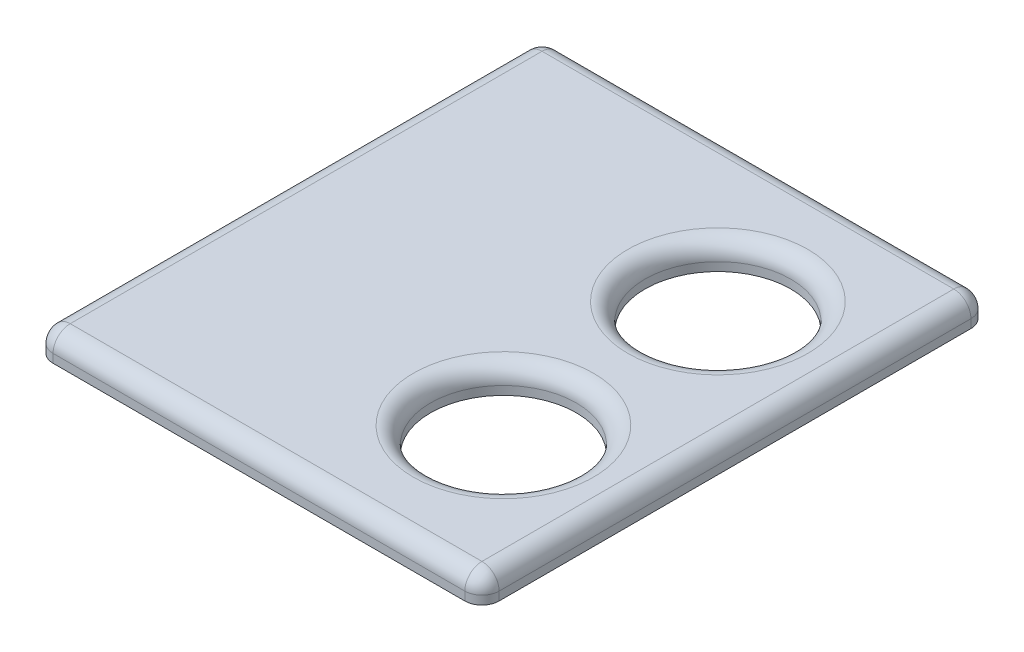
ISO-10303-21;
HEADER;
FILE_DESCRIPTION(('STEP AP214'),'2;1');
FILE_NAME('part.step','',(''),(''),'','','');
FILE_SCHEMA(('AUTOMOTIVE_DESIGN { 1 0 10303 214 1 1 1 1 }'));
ENDSEC;
DATA;
#1=APPLICATION_CONTEXT('core data for automotive mechanical design processes');
#2=APPLICATION_PROTOCOL_DEFINITION('international standard','automotive_design',2000,#1);
#3=PRODUCT_CONTEXT('',#1,'mechanical');
#4=PRODUCT('Part','Part','',(#3));
#5=PRODUCT_RELATED_PRODUCT_CATEGORY('part','',(#4));
#6=PRODUCT_DEFINITION_FORMATION('','',#4);
#7=PRODUCT_DEFINITION_CONTEXT('part definition',#1,'design');
#8=PRODUCT_DEFINITION('design','',#6,#7);
#9=PRODUCT_DEFINITION_SHAPE('','',#8);
#10=(LENGTH_UNIT() NAMED_UNIT(*) SI_UNIT(.MILLI.,.METRE.));
#11=(NAMED_UNIT(*) PLANE_ANGLE_UNIT() SI_UNIT($,.RADIAN.));
#12=(NAMED_UNIT(*) SI_UNIT($,.STERADIAN.) SOLID_ANGLE_UNIT());
#13=UNCERTAINTY_MEASURE_WITH_UNIT(LENGTH_MEASURE(1.E-05),#10,'distance_accuracy_value','');
#14=(GEOMETRIC_REPRESENTATION_CONTEXT(3) GLOBAL_UNCERTAINTY_ASSIGNED_CONTEXT((#13)) GLOBAL_UNIT_ASSIGNED_CONTEXT((#10,
#11,#12)) REPRESENTATION_CONTEXT('',''));
#15=CARTESIAN_POINT('',(0.,0.,0.));
#16=DIRECTION('',(0.,0.,1.));
#17=DIRECTION('',(1.,0.,0.));
#18=AXIS2_PLACEMENT_3D('',#15,#16,#17);
#19=CARTESIAN_POINT('',(37.5,21.,0.));
#20=DIRECTION('',(-1.,0.,0.));
#21=DIRECTION('',(0.,0.,1.));
#22=AXIS2_PLACEMENT_3D('',#19,#20,#21);
#23=PLANE('',#22);
#24=DIRECTION('',(0.,0.,-1.));
#25=VECTOR('',#24,1.);
#26=CARTESIAN_POINT('',(37.5,18.,0.));
#27=LINE('',#26,#25);
#28=CARTESIAN_POINT('',(37.5,18.,27.5));
#29=VERTEX_POINT('',#28);
#30=CARTESIAN_POINT('',(37.5,18.,-27.5));
#31=VERTEX_POINT('',#30);
#32=EDGE_CURVE('E218',#29,#31,#27,.T.);
#33=ORIENTED_EDGE('',*,*,#32,.T.);
#34=DIRECTION('',(0.,-1.,0.));
#35=VECTOR('',#34,1.);
#36=CARTESIAN_POINT('',(37.5,21.,-27.5));
#37=LINE('',#36,#35);
#38=CARTESIAN_POINT('',(37.5,19.,-27.5));
#39=VERTEX_POINT('',#38);
#40=EDGE_CURVE('E58',#31,#39,#37,.F.);
#41=ORIENTED_EDGE('',*,*,#40,.T.);
#42=DIRECTION('',(0.,0.,-1.));
#43=VECTOR('',#42,1.);
#44=CARTESIAN_POINT('',(37.5,19.,29.5));
#45=LINE('',#44,#43);
#46=CARTESIAN_POINT('',(37.5,19.,27.5));
#47=VERTEX_POINT('',#46);
#48=EDGE_CURVE('E63',#39,#47,#45,.F.);
#49=ORIENTED_EDGE('',*,*,#48,.T.);
#50=DIRECTION('',(0.,-1.,0.));
#51=VECTOR('',#50,1.);
#52=CARTESIAN_POINT('',(37.5,21.,27.5));
#53=LINE('',#52,#51);
#54=EDGE_CURVE('E187',#47,#29,#53,.T.);
#55=ORIENTED_EDGE('',*,*,#54,.T.);
#56=EDGE_LOOP('',(#33,#41,#49,#55));
#57=FACE_BOUND('',#56,.T.);
#58=ADVANCED_FACE('F41',(#57),#23,.F.);
#59=CARTESIAN_POINT('',(0.,21.,-29.5));
#60=DIRECTION('',(0.,0.,1.));
#61=DIRECTION('',(1.,0.,0.));
#62=AXIS2_PLACEMENT_3D('',#59,#60,#61);
#63=PLANE('',#62);
#64=DIRECTION('',(-1.,0.,0.));
#65=VECTOR('',#64,1.);
#66=CARTESIAN_POINT('',(37.5,19.,-29.5));
#67=LINE('',#66,#65);
#68=CARTESIAN_POINT('',(-12.5,19.,-29.5));
#69=VERTEX_POINT('',#68);
#70=CARTESIAN_POINT('',(35.5,19.,-29.5));
#71=VERTEX_POINT('',#70);
#72=EDGE_CURVE('E183',#69,#71,#67,.F.);
#73=ORIENTED_EDGE('',*,*,#72,.T.);
#74=DIRECTION('',(0.,-1.,0.));
#75=VECTOR('',#74,1.);
#76=CARTESIAN_POINT('',(35.5,21.,-29.5));
#77=LINE('',#76,#75);
#78=CARTESIAN_POINT('',(35.5,18.,-29.5));
#79=VERTEX_POINT('',#78);
#80=EDGE_CURVE('E185',#71,#79,#77,.T.);
#81=ORIENTED_EDGE('',*,*,#80,.T.);
#82=DIRECTION('',(-1.,0.,0.));
#83=VECTOR('',#82,1.);
#84=CARTESIAN_POINT('',(0.,18.,-29.5));
#85=LINE('',#84,#83);
#86=CARTESIAN_POINT('',(-12.5,18.,-29.5));
#87=VERTEX_POINT('',#86);
#88=EDGE_CURVE('E220',#79,#87,#85,.T.);
#89=ORIENTED_EDGE('',*,*,#88,.T.);
#90=DIRECTION('',(0.,-1.,0.));
#91=VECTOR('',#90,1.);
#92=CARTESIAN_POINT('',(-12.5,21.,-29.5));
#93=LINE('',#92,#91);
#94=EDGE_CURVE('E181',#87,#69,#93,.F.);
#95=ORIENTED_EDGE('',*,*,#94,.T.);
#96=EDGE_LOOP('',(#73,#81,#89,#95));
#97=FACE_BOUND('',#96,.T.);
#98=ADVANCED_FACE('F280',(#97),#63,.F.);
#99=CARTESIAN_POINT('',(-14.5,21.,0.));
#100=DIRECTION('',(1.,0.,0.));
#101=DIRECTION('',(0.,0.,-1.));
#102=AXIS2_PLACEMENT_3D('',#99,#100,#101);
#103=PLANE('',#102);
#104=DIRECTION('',(0.,0.,1.));
#105=VECTOR('',#104,1.);
#106=CARTESIAN_POINT('',(-14.5,19.,-29.5));
#107=LINE('',#106,#105);
#108=CARTESIAN_POINT('',(-14.5,19.,27.5));
#109=VERTEX_POINT('',#108);
#110=CARTESIAN_POINT('',(-14.5,19.,-27.5));
#111=VERTEX_POINT('',#110);
#112=EDGE_CURVE('E177',#109,#111,#107,.F.);
#113=ORIENTED_EDGE('',*,*,#112,.T.);
#114=DIRECTION('',(0.,-1.,0.));
#115=VECTOR('',#114,1.);
#116=CARTESIAN_POINT('',(-14.5,21.,-27.5));
#117=LINE('',#116,#115);
#118=CARTESIAN_POINT('',(-14.5,18.,-27.5));
#119=VERTEX_POINT('',#118);
#120=EDGE_CURVE('E179',#111,#119,#117,.T.);
#121=ORIENTED_EDGE('',*,*,#120,.T.);
#122=DIRECTION('',(0.,0.,1.));
#123=VECTOR('',#122,1.);
#124=CARTESIAN_POINT('',(-14.5,18.,0.));
#125=LINE('',#124,#123);
#126=CARTESIAN_POINT('',(-14.5,18.,27.5));
#127=VERTEX_POINT('',#126);
#128=EDGE_CURVE('E224',#119,#127,#125,.T.);
#129=ORIENTED_EDGE('',*,*,#128,.T.);
#130=DIRECTION('',(0.,-1.,0.));
#131=VECTOR('',#130,1.);
#132=CARTESIAN_POINT('',(-14.5,21.,27.5));
#133=LINE('',#132,#131);
#134=EDGE_CURVE('E175',#127,#109,#133,.F.);
#135=ORIENTED_EDGE('',*,*,#134,.T.);
#136=EDGE_LOOP('',(#113,#121,#129,#135));
#137=FACE_BOUND('',#136,.T.);
#138=ADVANCED_FACE('F287',(#137),#103,.F.);
#139=CARTESIAN_POINT('',(23.,21.,-12.5));
#140=DIRECTION('',(0.,-1.,0.));
#141=DIRECTION('',(0.,0.,-1.));
#142=AXIS2_PLACEMENT_3D('',#139,#140,#141);
#143=CYLINDRICAL_SURFACE('',#142,8.5);
#144=CARTESIAN_POINT('',(23.,19.,-12.5));
#145=DIRECTION('',(0.,1.,0.));
#146=DIRECTION('',(0.,0.,1.));
#147=AXIS2_PLACEMENT_3D('',#144,#145,#146);
#148=CIRCLE('',#147,8.5);
#149=CARTESIAN_POINT('',(23.,19.,-4.));
#150=VERTEX_POINT('',#149);
#151=EDGE_CURVE('E167',#150,#150,#148,.T.);
#152=ORIENTED_EDGE('',*,*,#151,.T.);
#153=EDGE_LOOP('',(#152));
#154=FACE_BOUND('',#153,.T.);
#155=CARTESIAN_POINT('',(23.,18.,-12.5));
#156=DIRECTION('',(0.,1.,0.));
#157=DIRECTION('',(0.,0.,1.));
#158=AXIS2_PLACEMENT_3D('',#155,#156,#157);
#159=CIRCLE('',#158,8.5);
#160=CARTESIAN_POINT('',(23.,18.,-4.));
#161=VERTEX_POINT('',#160);
#162=EDGE_CURVE('E232',#161,#161,#159,.T.);
#163=ORIENTED_EDGE('',*,*,#162,.F.);
#164=EDGE_LOOP('',(#163));
#165=FACE_BOUND('',#164,.T.);
#166=ADVANCED_FACE('F433',(#154,#165),#143,.F.);
#167=CARTESIAN_POINT('',(0.,21.,29.5));
#168=DIRECTION('',(0.,0.,-1.));
#169=DIRECTION('',(-1.,0.,0.));
#170=AXIS2_PLACEMENT_3D('',#167,#168,#169);
#171=PLANE('',#170);
#172=DIRECTION('',(1.,0.,0.));
#173=VECTOR('',#172,1.);
#174=CARTESIAN_POINT('',(-14.5,19.,29.5));
#175=LINE('',#174,#173);
#176=CARTESIAN_POINT('',(35.5,19.,29.5));
#177=VERTEX_POINT('',#176);
#178=CARTESIAN_POINT('',(-12.5,19.,29.5));
#179=VERTEX_POINT('',#178);
#180=EDGE_CURVE('E126',#177,#179,#175,.F.);
#181=ORIENTED_EDGE('',*,*,#180,.T.);
#182=DIRECTION('',(0.,-1.,0.));
#183=VECTOR('',#182,1.);
#184=CARTESIAN_POINT('',(-12.5,21.,29.5));
#185=LINE('',#184,#183);
#186=CARTESIAN_POINT('',(-12.5,18.,29.5));
#187=VERTEX_POINT('',#186);
#188=EDGE_CURVE('E173',#179,#187,#185,.T.);
#189=ORIENTED_EDGE('',*,*,#188,.T.);
#190=DIRECTION('',(1.,0.,0.));
#191=VECTOR('',#190,1.);
#192=CARTESIAN_POINT('',(0.,18.,29.5));
#193=LINE('',#192,#191);
#194=CARTESIAN_POINT('',(35.5,18.,29.5));
#195=VERTEX_POINT('',#194);
#196=EDGE_CURVE('E229',#187,#195,#193,.T.);
#197=ORIENTED_EDGE('',*,*,#196,.T.);
#198=DIRECTION('',(0.,-1.,0.));
#199=VECTOR('',#198,1.);
#200=CARTESIAN_POINT('',(35.5,21.,29.5));
#201=LINE('',#200,#199);
#202=EDGE_CURVE('E170',#195,#177,#201,.F.);
#203=ORIENTED_EDGE('',*,*,#202,.T.);
#204=EDGE_LOOP('',(#181,#189,#197,#203));
#205=FACE_BOUND('',#204,.T.);
#206=ADVANCED_FACE('F255',(#205),#171,.F.);
#207=CARTESIAN_POINT('',(23.,21.,12.5));
#208=DIRECTION('',(0.,-1.,0.));
#209=DIRECTION('',(0.,0.,-1.));
#210=AXIS2_PLACEMENT_3D('',#207,#208,#209);
#211=CYLINDRICAL_SURFACE('',#210,8.5);
#212=CARTESIAN_POINT('',(23.,19.,12.5));
#213=DIRECTION('',(0.,1.,0.));
#214=DIRECTION('',(0.,0.,1.));
#215=AXIS2_PLACEMENT_3D('',#212,#213,#214);
#216=CIRCLE('',#215,8.5);
#217=CARTESIAN_POINT('',(23.,19.,21.));
#218=VERTEX_POINT('',#217);
#219=EDGE_CURVE('E164',#218,#218,#216,.T.);
#220=ORIENTED_EDGE('',*,*,#219,.T.);
#221=EDGE_LOOP('',(#220));
#222=FACE_BOUND('',#221,.T.);
#223=CARTESIAN_POINT('',(23.,18.,12.5));
#224=DIRECTION('',(0.,1.,0.));
#225=DIRECTION('',(0.,0.,1.));
#226=AXIS2_PLACEMENT_3D('',#223,#224,#225);
#227=CIRCLE('',#226,8.5);
#228=CARTESIAN_POINT('',(23.,18.,21.));
#229=VERTEX_POINT('',#228);
#230=EDGE_CURVE('E148',#229,#229,#227,.F.);
#231=ORIENTED_EDGE('',*,*,#230,.T.);
#232=EDGE_LOOP('',(#231));
#233=FACE_BOUND('',#232,.T.);
#234=ADVANCED_FACE('F414',(#222,#233),#211,.F.);
#235=CARTESIAN_POINT('',(0.,21.,0.));
#236=DIRECTION('',(0.,1.,0.));
#237=DIRECTION('',(0.,0.,1.));
#238=AXIS2_PLACEMENT_3D('',#235,#236,#237);
#239=PLANE('',#238);
#240=CARTESIAN_POINT('',(23.,21.,12.5));
#241=DIRECTION('',(0.,1.,0.));
#242=DIRECTION('',(0.,0.,1.));
#243=AXIS2_PLACEMENT_3D('',#240,#241,#242);
#244=CIRCLE('',#243,10.5);
#245=CARTESIAN_POINT('',(23.,21.,23.));
#246=VERTEX_POINT('',#245);
#247=EDGE_CURVE('E157',#246,#246,#244,.F.);
#248=ORIENTED_EDGE('',*,*,#247,.T.);
#249=EDGE_LOOP('',(#248));
#250=FACE_BOUND('',#249,.T.);
#251=CARTESIAN_POINT('',(23.,21.,-12.5));
#252=DIRECTION('',(0.,1.,0.));
#253=DIRECTION('',(0.,0.,1.));
#254=AXIS2_PLACEMENT_3D('',#251,#252,#253);
#255=CIRCLE('',#254,10.5);
#256=CARTESIAN_POINT('',(23.,21.,-2.));
#257=VERTEX_POINT('',#256);
#258=EDGE_CURVE('E154',#257,#257,#255,.F.);
#259=ORIENTED_EDGE('',*,*,#258,.T.);
#260=EDGE_LOOP('',(#259));
#261=FACE_BOUND('',#260,.T.);
#262=DIRECTION('',(0.,0.,1.));
#263=VECTOR('',#262,1.);
#264=CARTESIAN_POINT('',(-12.5,21.,29.5));
#265=LINE('',#264,#263);
#266=CARTESIAN_POINT('',(-12.5,21.,-27.5));
#267=VERTEX_POINT('',#266);
#268=CARTESIAN_POINT('',(-12.5,21.,27.5));
#269=VERTEX_POINT('',#268);
#270=EDGE_CURVE('E152',#267,#269,#265,.T.);
#271=ORIENTED_EDGE('',*,*,#270,.T.);
#272=DIRECTION('',(1.,0.,0.));
#273=VECTOR('',#272,1.);
#274=CARTESIAN_POINT('',(37.5,21.,27.5));
#275=LINE('',#274,#273);
#276=CARTESIAN_POINT('',(35.5,21.,27.5));
#277=VERTEX_POINT('',#276);
#278=EDGE_CURVE('E124',#269,#277,#275,.T.);
#279=ORIENTED_EDGE('',*,*,#278,.T.);
#280=DIRECTION('',(0.,0.,-1.));
#281=VECTOR('',#280,1.);
#282=CARTESIAN_POINT('',(35.5,21.,-29.5));
#283=LINE('',#282,#281);
#284=CARTESIAN_POINT('',(35.5,21.,-27.5));
#285=VERTEX_POINT('',#284);
#286=EDGE_CURVE('E141',#277,#285,#283,.T.);
#287=ORIENTED_EDGE('',*,*,#286,.T.);
#288=DIRECTION('',(-1.,0.,0.));
#289=VECTOR('',#288,1.);
#290=CARTESIAN_POINT('',(-14.5,21.,-27.5));
#291=LINE('',#290,#289);
#292=EDGE_CURVE('E147',#285,#267,#291,.T.);
#293=ORIENTED_EDGE('',*,*,#292,.T.);
#294=EDGE_LOOP('',(#271,#279,#287,#293));
#295=FACE_BOUND('',#294,.T.);
#296=ADVANCED_FACE('F150',(#250,#261,#295),#239,.T.);
#297=CARTESIAN_POINT('',(0.,18.,0.));
#298=DIRECTION('',(0.,1.,0.));
#299=DIRECTION('',(0.,0.,1.));
#300=AXIS2_PLACEMENT_3D('',#297,#298,#299);
#301=PLANE('',#300);
#302=ORIENTED_EDGE('',*,*,#88,.F.);
#303=CARTESIAN_POINT('',(35.5,18.,-27.5));
#304=DIRECTION('',(0.,1.,0.));
#305=DIRECTION('',(0.,0.,1.));
#306=AXIS2_PLACEMENT_3D('',#303,#304,#305);
#307=CIRCLE('',#306,2.);
#308=EDGE_CURVE('E11',#79,#31,#307,.F.);
#309=ORIENTED_EDGE('',*,*,#308,.T.);
#310=ORIENTED_EDGE('',*,*,#32,.F.);
#311=CARTESIAN_POINT('',(35.5,18.,27.5));
#312=DIRECTION('',(0.,1.,0.));
#313=DIRECTION('',(0.,0.,1.));
#314=AXIS2_PLACEMENT_3D('',#311,#312,#313);
#315=CIRCLE('',#314,2.);
#316=EDGE_CURVE('E191',#29,#195,#315,.F.);
#317=ORIENTED_EDGE('',*,*,#316,.T.);
#318=ORIENTED_EDGE('',*,*,#196,.F.);
#319=CARTESIAN_POINT('',(-12.5,18.,27.5));
#320=DIRECTION('',(0.,1.,0.));
#321=DIRECTION('',(0.,0.,1.));
#322=AXIS2_PLACEMENT_3D('',#319,#320,#321);
#323=CIRCLE('',#322,2.);
#324=EDGE_CURVE('E193',#187,#127,#323,.F.);
#325=ORIENTED_EDGE('',*,*,#324,.T.);
#326=ORIENTED_EDGE('',*,*,#128,.F.);
#327=CARTESIAN_POINT('',(-12.5,18.,-27.5));
#328=DIRECTION('',(0.,1.,0.));
#329=DIRECTION('',(0.,0.,1.));
#330=AXIS2_PLACEMENT_3D('',#327,#328,#329);
#331=CIRCLE('',#330,2.);
#332=EDGE_CURVE('E50',#119,#87,#331,.F.);
#333=ORIENTED_EDGE('',*,*,#332,.T.);
#334=EDGE_LOOP('',(#302,#309,#310,#317,#318,#325,#326,#333));
#335=FACE_BOUND('',#334,.T.);
#336=ORIENTED_EDGE('',*,*,#162,.T.);
#337=EDGE_LOOP('',(#336));
#338=FACE_BOUND('',#337,.T.);
#339=ORIENTED_EDGE('',*,*,#230,.F.);
#340=EDGE_LOOP('',(#339));
#341=FACE_BOUND('',#340,.T.);
#342=ADVANCED_FACE('F262',(#335,#338,#341),#301,.F.);
#343=CARTESIAN_POINT('',(23.,19.,12.5));
#344=DIRECTION('',(0.,1.,0.));
#345=DIRECTION('',(0.,0.,1.));
#346=AXIS2_PLACEMENT_3D('',#343,#344,#345);
#347=TOROIDAL_SURFACE('',#346,10.5,2.);
#348=ORIENTED_EDGE('',*,*,#219,.F.);
#349=EDGE_LOOP('',(#348));
#350=FACE_BOUND('',#349,.T.);
#351=ORIENTED_EDGE('',*,*,#247,.F.);
#352=EDGE_LOOP('',(#351));
#353=FACE_BOUND('',#352,.T.);
#354=ADVANCED_FACE('F292',(#350,#353),#347,.T.);
#355=CARTESIAN_POINT('',(23.,19.,-12.5));
#356=DIRECTION('',(0.,1.,0.));
#357=DIRECTION('',(0.,0.,1.));
#358=AXIS2_PLACEMENT_3D('',#355,#356,#357);
#359=TOROIDAL_SURFACE('',#358,10.5,2.);
#360=ORIENTED_EDGE('',*,*,#258,.F.);
#361=EDGE_LOOP('',(#360));
#362=FACE_BOUND('',#361,.T.);
#363=ORIENTED_EDGE('',*,*,#151,.F.);
#364=EDGE_LOOP('',(#363));
#365=FACE_BOUND('',#364,.T.);
#366=ADVANCED_FACE('F295',(#362,#365),#359,.T.);
#367=CARTESIAN_POINT('',(-12.5,21.,-27.5));
#368=DIRECTION('',(0.,-1.,0.));
#369=DIRECTION('',(0.,0.,-1.));
#370=AXIS2_PLACEMENT_3D('',#367,#368,#369);
#371=CYLINDRICAL_SURFACE('',#370,2.);
#372=ORIENTED_EDGE('',*,*,#332,.F.);
#373=ORIENTED_EDGE('',*,*,#120,.F.);
#374=CARTESIAN_POINT('',(-12.5,19.,-27.5));
#375=DIRECTION('',(0.,1.,0.));
#376=DIRECTION('',(0.,0.,1.));
#377=AXIS2_PLACEMENT_3D('',#374,#375,#376);
#378=CIRCLE('',#377,2.);
#379=EDGE_CURVE('E45',#69,#111,#378,.T.);
#380=ORIENTED_EDGE('',*,*,#379,.F.);
#381=ORIENTED_EDGE('',*,*,#94,.F.);
#382=EDGE_LOOP('',(#372,#373,#380,#381));
#383=FACE_BOUND('',#382,.T.);
#384=ADVANCED_FACE('F43',(#383),#371,.T.);
#385=CARTESIAN_POINT('',(0.,19.,-27.5));
#386=DIRECTION('',(1.,0.,0.));
#387=DIRECTION('',(0.,0.,-1.));
#388=AXIS2_PLACEMENT_3D('',#385,#386,#387);
#389=CYLINDRICAL_SURFACE('',#388,2.);
#390=CARTESIAN_POINT('',(35.5,19.,-27.5));
#391=DIRECTION('',(1.,0.,0.));
#392=DIRECTION('',(0.,0.,-1.));
#393=AXIS2_PLACEMENT_3D('',#390,#391,#392);
#394=CIRCLE('',#393,2.);
#395=EDGE_CURVE('E210',#71,#285,#394,.T.);
#396=ORIENTED_EDGE('',*,*,#395,.F.);
#397=ORIENTED_EDGE('',*,*,#72,.F.);
#398=CARTESIAN_POINT('',(-12.5,19.,-27.5));
#399=DIRECTION('',(-1.,0.,0.));
#400=DIRECTION('',(0.,0.,1.));
#401=AXIS2_PLACEMENT_3D('',#398,#399,#400);
#402=CIRCLE('',#401,2.);
#403=EDGE_CURVE('E212',#267,#69,#402,.T.);
#404=ORIENTED_EDGE('',*,*,#403,.F.);
#405=ORIENTED_EDGE('',*,*,#292,.F.);
#406=EDGE_LOOP('',(#396,#397,#404,#405));
#407=FACE_BOUND('',#406,.T.);
#408=ADVANCED_FACE('F239',(#407),#389,.T.);
#409=CARTESIAN_POINT('',(35.5,21.,-27.5));
#410=DIRECTION('',(0.,-1.,0.));
#411=DIRECTION('',(0.,0.,-1.));
#412=AXIS2_PLACEMENT_3D('',#409,#410,#411);
#413=CYLINDRICAL_SURFACE('',#412,2.);
#414=ORIENTED_EDGE('',*,*,#308,.F.);
#415=ORIENTED_EDGE('',*,*,#80,.F.);
#416=CARTESIAN_POINT('',(35.5,19.,-27.5));
#417=DIRECTION('',(0.,1.,0.));
#418=DIRECTION('',(0.,0.,1.));
#419=AXIS2_PLACEMENT_3D('',#416,#417,#418);
#420=CIRCLE('',#419,2.);
#421=EDGE_CURVE('E207',#39,#71,#420,.T.);
#422=ORIENTED_EDGE('',*,*,#421,.F.);
#423=ORIENTED_EDGE('',*,*,#40,.F.);
#424=EDGE_LOOP('',(#414,#415,#422,#423));
#425=FACE_BOUND('',#424,.T.);
#426=ADVANCED_FACE('F267',(#425),#413,.T.);
#427=CARTESIAN_POINT('',(-12.5,19.,-27.5));
#428=DIRECTION('',(0.,0.,-1.));
#429=DIRECTION('',(-1.,0.,0.));
#430=AXIS2_PLACEMENT_3D('',#427,#428,#429);
#431=SPHERICAL_SURFACE('',#430,2.);
#432=ORIENTED_EDGE('',*,*,#403,.T.);
#433=ORIENTED_EDGE('',*,*,#379,.T.);
#434=CARTESIAN_POINT('',(-12.5,19.,-27.5));
#435=DIRECTION('',(0.,0.,-1.));
#436=DIRECTION('',(0.,1.,0.));
#437=AXIS2_PLACEMENT_3D('',#434,#435,#436);
#438=CIRCLE('',#437,2.);
#439=EDGE_CURVE('E204',#267,#111,#438,.F.);
#440=ORIENTED_EDGE('',*,*,#439,.F.);
#441=EDGE_LOOP('',(#432,#433,#440));
#442=FACE_BOUND('',#441,.T.);
#443=ADVANCED_FACE('F240',(#442),#431,.T.);
#444=CARTESIAN_POINT('',(35.5,19.,-27.5));
#445=DIRECTION('',(0.,0.,-1.));
#446=DIRECTION('',(-1.,0.,0.));
#447=AXIS2_PLACEMENT_3D('',#444,#445,#446);
#448=SPHERICAL_SURFACE('',#447,2.);
#449=ORIENTED_EDGE('',*,*,#421,.T.);
#450=ORIENTED_EDGE('',*,*,#395,.T.);
#451=CARTESIAN_POINT('',(35.5,19.,-27.5));
#452=DIRECTION('',(0.,0.,-1.));
#453=DIRECTION('',(-1.,0.,0.));
#454=AXIS2_PLACEMENT_3D('',#451,#452,#453);
#455=CIRCLE('',#454,2.);
#456=EDGE_CURVE('E144',#39,#285,#455,.F.);
#457=ORIENTED_EDGE('',*,*,#456,.F.);
#458=EDGE_LOOP('',(#449,#450,#457));
#459=FACE_BOUND('',#458,.T.);
#460=ADVANCED_FACE('F269',(#459),#448,.T.);
#461=CARTESIAN_POINT('',(-12.5,21.,27.5));
#462=DIRECTION('',(0.,-1.,0.));
#463=DIRECTION('',(0.,0.,-1.));
#464=AXIS2_PLACEMENT_3D('',#461,#462,#463);
#465=CYLINDRICAL_SURFACE('',#464,2.);
#466=ORIENTED_EDGE('',*,*,#324,.F.);
#467=ORIENTED_EDGE('',*,*,#188,.F.);
#468=CARTESIAN_POINT('',(-12.5,19.,27.5));
#469=DIRECTION('',(0.,1.,0.));
#470=DIRECTION('',(0.,0.,1.));
#471=AXIS2_PLACEMENT_3D('',#468,#469,#470);
#472=CIRCLE('',#471,2.);
#473=EDGE_CURVE('E200',#109,#179,#472,.T.);
#474=ORIENTED_EDGE('',*,*,#473,.F.);
#475=ORIENTED_EDGE('',*,*,#134,.F.);
#476=EDGE_LOOP('',(#466,#467,#474,#475));
#477=FACE_BOUND('',#476,.T.);
#478=ADVANCED_FACE('F252',(#477),#465,.T.);
#479=CARTESIAN_POINT('',(-12.5,19.,0.));
#480=DIRECTION('',(0.,0.,-1.));
#481=DIRECTION('',(-1.,0.,0.));
#482=AXIS2_PLACEMENT_3D('',#479,#480,#481);
#483=CYLINDRICAL_SURFACE('',#482,2.);
#484=ORIENTED_EDGE('',*,*,#439,.T.);
#485=ORIENTED_EDGE('',*,*,#112,.F.);
#486=CARTESIAN_POINT('',(-12.5,19.,27.5));
#487=DIRECTION('',(0.,0.,1.));
#488=DIRECTION('',(1.,0.,0.));
#489=AXIS2_PLACEMENT_3D('',#486,#487,#488);
#490=CIRCLE('',#489,2.);
#491=EDGE_CURVE('E138',#269,#109,#490,.T.);
#492=ORIENTED_EDGE('',*,*,#491,.F.);
#493=ORIENTED_EDGE('',*,*,#270,.F.);
#494=EDGE_LOOP('',(#484,#485,#492,#493));
#495=FACE_BOUND('',#494,.T.);
#496=ADVANCED_FACE('F243',(#495),#483,.T.);
#497=CARTESIAN_POINT('',(35.5,19.,0.));
#498=DIRECTION('',(0.,0.,1.));
#499=DIRECTION('',(1.,0.,0.));
#500=AXIS2_PLACEMENT_3D('',#497,#498,#499);
#501=CYLINDRICAL_SURFACE('',#500,2.);
#502=ORIENTED_EDGE('',*,*,#456,.T.);
#503=ORIENTED_EDGE('',*,*,#286,.F.);
#504=CARTESIAN_POINT('',(35.5,19.,27.5));
#505=DIRECTION('',(0.,0.,1.));
#506=DIRECTION('',(1.,0.,0.));
#507=AXIS2_PLACEMENT_3D('',#504,#505,#506);
#508=CIRCLE('',#507,2.);
#509=EDGE_CURVE('E132',#47,#277,#508,.T.);
#510=ORIENTED_EDGE('',*,*,#509,.F.);
#511=ORIENTED_EDGE('',*,*,#48,.F.);
#512=EDGE_LOOP('',(#502,#503,#510,#511));
#513=FACE_BOUND('',#512,.T.);
#514=ADVANCED_FACE('F142',(#513),#501,.T.);
#515=CARTESIAN_POINT('',(35.5,21.,27.5));
#516=DIRECTION('',(0.,-1.,0.));
#517=DIRECTION('',(0.,0.,-1.));
#518=AXIS2_PLACEMENT_3D('',#515,#516,#517);
#519=CYLINDRICAL_SURFACE('',#518,2.);
#520=ORIENTED_EDGE('',*,*,#316,.F.);
#521=ORIENTED_EDGE('',*,*,#54,.F.);
#522=CARTESIAN_POINT('',(35.5,19.,27.5));
#523=DIRECTION('',(0.,1.,0.));
#524=DIRECTION('',(0.,0.,1.));
#525=AXIS2_PLACEMENT_3D('',#522,#523,#524);
#526=CIRCLE('',#525,2.);
#527=EDGE_CURVE('E136',#177,#47,#526,.T.);
#528=ORIENTED_EDGE('',*,*,#527,.F.);
#529=ORIENTED_EDGE('',*,*,#202,.F.);
#530=EDGE_LOOP('',(#520,#521,#528,#529));
#531=FACE_BOUND('',#530,.T.);
#532=ADVANCED_FACE('F259',(#531),#519,.T.);
#533=CARTESIAN_POINT('',(-12.5,19.,27.5));
#534=DIRECTION('',(-1.,0.,0.));
#535=DIRECTION('',(0.,0.,1.));
#536=AXIS2_PLACEMENT_3D('',#533,#534,#535);
#537=SPHERICAL_SURFACE('',#536,2.);
#538=ORIENTED_EDGE('',*,*,#491,.T.);
#539=ORIENTED_EDGE('',*,*,#473,.T.);
#540=CARTESIAN_POINT('',(-12.5,19.,27.5));
#541=DIRECTION('',(-1.,0.,0.));
#542=DIRECTION('',(0.,0.,1.));
#543=AXIS2_PLACEMENT_3D('',#540,#541,#542);
#544=CIRCLE('',#543,2.);
#545=EDGE_CURVE('E129',#269,#179,#544,.F.);
#546=ORIENTED_EDGE('',*,*,#545,.F.);
#547=EDGE_LOOP('',(#538,#539,#546));
#548=FACE_BOUND('',#547,.T.);
#549=ADVANCED_FACE('F247',(#548),#537,.T.);
#550=CARTESIAN_POINT('',(35.5,19.,27.5));
#551=DIRECTION('',(1.,0.,0.));
#552=DIRECTION('',(0.,0.,-1.));
#553=AXIS2_PLACEMENT_3D('',#550,#551,#552);
#554=SPHERICAL_SURFACE('',#553,2.);
#555=ORIENTED_EDGE('',*,*,#527,.T.);
#556=ORIENTED_EDGE('',*,*,#509,.T.);
#557=CARTESIAN_POINT('',(35.5,19.,27.5));
#558=DIRECTION('',(1.,0.,0.));
#559=DIRECTION('',(0.,0.,-1.));
#560=AXIS2_PLACEMENT_3D('',#557,#558,#559);
#561=CIRCLE('',#560,2.);
#562=EDGE_CURVE('E120',#177,#277,#561,.F.);
#563=ORIENTED_EDGE('',*,*,#562,.F.);
#564=EDGE_LOOP('',(#555,#556,#563));
#565=FACE_BOUND('',#564,.T.);
#566=ADVANCED_FACE('F134',(#565),#554,.T.);
#567=CARTESIAN_POINT('',(0.,19.,27.5));
#568=DIRECTION('',(-1.,0.,0.));
#569=DIRECTION('',(0.,0.,1.));
#570=AXIS2_PLACEMENT_3D('',#567,#568,#569);
#571=CYLINDRICAL_SURFACE('',#570,2.);
#572=ORIENTED_EDGE('',*,*,#545,.T.);
#573=ORIENTED_EDGE('',*,*,#180,.F.);
#574=ORIENTED_EDGE('',*,*,#562,.T.);
#575=ORIENTED_EDGE('',*,*,#278,.F.);
#576=EDGE_LOOP('',(#572,#573,#574,#575));
#577=FACE_BOUND('',#576,.T.);
#578=ADVANCED_FACE('F122',(#577),#571,.T.);
#579=CLOSED_SHELL('',(#58,#98,#138,#166,#206,#234,#296,#342,#354,#366,#384,#408,#426,#443,#460,
#478,#496,#514,#532,#549,#566,#578));
#580=MANIFOLD_SOLID_BREP('B2',#579);
#581=ADVANCED_BREP_SHAPE_REPRESENTATION('',(#18,#580),#14);
#582=SHAPE_DEFINITION_REPRESENTATION(#9,#581);
ENDSEC;
END-ISO-10303-21;
